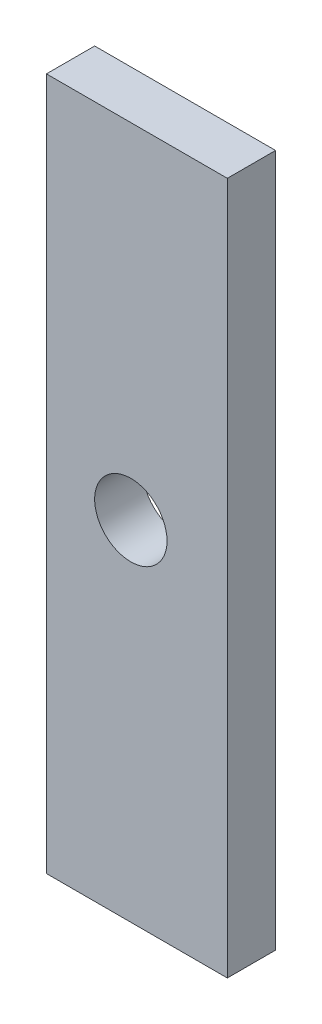
ISO-10303-21;
HEADER;
FILE_DESCRIPTION(('STEP AP214'),'2;1');
FILE_NAME('part.step','',(''),(''),'','','');
FILE_SCHEMA(('AUTOMOTIVE_DESIGN { 1 0 10303 214 1 1 1 1 }'));
ENDSEC;
DATA;
#1=APPLICATION_CONTEXT('core data for automotive mechanical design processes');
#2=APPLICATION_PROTOCOL_DEFINITION('international standard','automotive_design',2000,#1);
#3=PRODUCT_CONTEXT('',#1,'mechanical');
#4=PRODUCT('Part','Part','',(#3));
#5=PRODUCT_RELATED_PRODUCT_CATEGORY('part','',(#4));
#6=PRODUCT_DEFINITION_FORMATION('','',#4);
#7=PRODUCT_DEFINITION_CONTEXT('part definition',#1,'design');
#8=PRODUCT_DEFINITION('design','',#6,#7);
#9=PRODUCT_DEFINITION_SHAPE('','',#8);
#10=(LENGTH_UNIT() NAMED_UNIT(*) SI_UNIT(.MILLI.,.METRE.));
#11=(NAMED_UNIT(*) PLANE_ANGLE_UNIT() SI_UNIT($,.RADIAN.));
#12=(NAMED_UNIT(*) SI_UNIT($,.STERADIAN.) SOLID_ANGLE_UNIT());
#13=UNCERTAINTY_MEASURE_WITH_UNIT(LENGTH_MEASURE(1.E-05),#10,'distance_accuracy_value','');
#14=(GEOMETRIC_REPRESENTATION_CONTEXT(3) GLOBAL_UNCERTAINTY_ASSIGNED_CONTEXT((#13)) GLOBAL_UNIT_ASSIGNED_CONTEXT((#10,
#11,#12)) REPRESENTATION_CONTEXT('',''));
#15=CARTESIAN_POINT('',(0.,0.,0.));
#16=DIRECTION('',(0.,0.,1.));
#17=DIRECTION('',(1.,0.,0.));
#18=AXIS2_PLACEMENT_3D('',#15,#16,#17);
#19=CARTESIAN_POINT('',(0.,0.,2.));
#20=DIRECTION('',(0.,0.,-1.));
#21=DIRECTION('',(-1.,0.,0.));
#22=AXIS2_PLACEMENT_3D('',#19,#20,#21);
#23=PLANE('',#22);
#24=DIRECTION('',(0.,1.,0.));
#25=VECTOR('',#24,1.);
#26=CARTESIAN_POINT('',(4.,-14.441,2.));
#27=LINE('',#26,#25);
#28=CARTESIAN_POINT('',(4.,-14.441,2.));
#29=VERTEX_POINT('',#28);
#30=CARTESIAN_POINT('',(4.,14.2719690936802,2.));
#31=VERTEX_POINT('',#30);
#32=EDGE_CURVE('E84',#29,#31,#27,.T.);
#33=ORIENTED_EDGE('',*,*,#32,.T.);
#34=DIRECTION('',(-1.,0.,0.));
#35=VECTOR('',#34,1.);
#36=CARTESIAN_POINT('',(-3.5,14.2719690936802,2.));
#37=LINE('',#36,#35);
#38=CARTESIAN_POINT('',(-3.5,14.2719690936802,2.));
#39=VERTEX_POINT('',#38);
#40=EDGE_CURVE('E79',#31,#39,#37,.T.);
#41=ORIENTED_EDGE('',*,*,#40,.T.);
#42=DIRECTION('',(0.,-1.,0.));
#43=VECTOR('',#42,1.);
#44=CARTESIAN_POINT('',(-3.5,14.2719690936802,2.));
#45=LINE('',#44,#43);
#46=CARTESIAN_POINT('',(-3.5,-14.441,2.));
#47=VERTEX_POINT('',#46);
#48=EDGE_CURVE('E82',#39,#47,#45,.T.);
#49=ORIENTED_EDGE('',*,*,#48,.T.);
#50=DIRECTION('',(1.,0.,0.));
#51=VECTOR('',#50,1.);
#52=CARTESIAN_POINT('',(-3.5,-14.441,2.));
#53=LINE('',#52,#51);
#54=EDGE_CURVE('E49',#47,#29,#53,.T.);
#55=ORIENTED_EDGE('',*,*,#54,.T.);
#56=EDGE_LOOP('',(#33,#41,#49,#55));
#57=FACE_BOUND('',#56,.T.);
#58=CARTESIAN_POINT('',(0.,0.,2.));
#59=DIRECTION('',(0.,0.,1.));
#60=DIRECTION('',(1.,0.,0.));
#61=AXIS2_PLACEMENT_3D('',#58,#59,#60);
#62=CIRCLE('',#61,1.5);
#63=CARTESIAN_POINT('',(1.5,0.,2.));
#64=VERTEX_POINT('',#63);
#65=EDGE_CURVE('E99',#64,#64,#62,.T.);
#66=ORIENTED_EDGE('',*,*,#65,.F.);
#67=EDGE_LOOP('',(#66));
#68=FACE_BOUND('',#67,.T.);
#69=ADVANCED_FACE('F32',(#57,#68),#23,.F.);
#70=CARTESIAN_POINT('',(0.,0.,0.));
#71=DIRECTION('',(0.,0.,-1.));
#72=DIRECTION('',(-1.,0.,0.));
#73=AXIS2_PLACEMENT_3D('',#70,#71,#72);
#74=PLANE('',#73);
#75=DIRECTION('',(0.,1.,0.));
#76=VECTOR('',#75,1.);
#77=CARTESIAN_POINT('',(4.,-14.441,0.));
#78=LINE('',#77,#76);
#79=CARTESIAN_POINT('',(4.,-14.441,0.));
#80=VERTEX_POINT('',#79);
#81=CARTESIAN_POINT('',(4.,14.2719690936802,0.));
#82=VERTEX_POINT('',#81);
#83=EDGE_CURVE('E96',#80,#82,#78,.T.);
#84=ORIENTED_EDGE('',*,*,#83,.F.);
#85=DIRECTION('',(1.,0.,0.));
#86=VECTOR('',#85,1.);
#87=CARTESIAN_POINT('',(-3.5,-14.441,0.));
#88=LINE('',#87,#86);
#89=CARTESIAN_POINT('',(-3.5,-14.441,0.));
#90=VERTEX_POINT('',#89);
#91=EDGE_CURVE('E72',#90,#80,#88,.T.);
#92=ORIENTED_EDGE('',*,*,#91,.F.);
#93=DIRECTION('',(0.,-1.,0.));
#94=VECTOR('',#93,1.);
#95=CARTESIAN_POINT('',(-3.5,14.2719690936802,0.));
#96=LINE('',#95,#94);
#97=CARTESIAN_POINT('',(-3.5,14.2719690936802,0.));
#98=VERTEX_POINT('',#97);
#99=EDGE_CURVE('E66',#98,#90,#96,.T.);
#100=ORIENTED_EDGE('',*,*,#99,.F.);
#101=DIRECTION('',(-1.,0.,0.));
#102=VECTOR('',#101,1.);
#103=CARTESIAN_POINT('',(-3.5,14.2719690936802,0.));
#104=LINE('',#103,#102);
#105=EDGE_CURVE('E88',#82,#98,#104,.T.);
#106=ORIENTED_EDGE('',*,*,#105,.F.);
#107=EDGE_LOOP('',(#84,#92,#100,#106));
#108=FACE_BOUND('',#107,.T.);
#109=CARTESIAN_POINT('',(0.,0.,0.));
#110=DIRECTION('',(0.,0.,1.));
#111=DIRECTION('',(1.,0.,0.));
#112=AXIS2_PLACEMENT_3D('',#109,#110,#111);
#113=CIRCLE('',#112,1.5);
#114=CARTESIAN_POINT('',(1.5,0.,0.));
#115=VERTEX_POINT('',#114);
#116=EDGE_CURVE('E111',#115,#115,#113,.T.);
#117=ORIENTED_EDGE('',*,*,#116,.T.);
#118=EDGE_LOOP('',(#117));
#119=FACE_BOUND('',#118,.T.);
#120=ADVANCED_FACE('F107',(#108,#119),#74,.T.);
#121=CARTESIAN_POINT('',(4.,-14.441,2.));
#122=DIRECTION('',(-1.,0.,0.));
#123=DIRECTION('',(0.,-1.,0.));
#124=AXIS2_PLACEMENT_3D('',#121,#122,#123);
#125=PLANE('',#124);
#126=ORIENTED_EDGE('',*,*,#83,.T.);
#127=DIRECTION('',(0.,0.,-1.));
#128=VECTOR('',#127,1.);
#129=CARTESIAN_POINT('',(4.,14.2719690936802,2.));
#130=LINE('',#129,#128);
#131=EDGE_CURVE('E11',#31,#82,#130,.T.);
#132=ORIENTED_EDGE('',*,*,#131,.F.);
#133=ORIENTED_EDGE('',*,*,#32,.F.);
#134=DIRECTION('',(0.,0.,-1.));
#135=VECTOR('',#134,1.);
#136=CARTESIAN_POINT('',(4.,-14.441,2.));
#137=LINE('',#136,#135);
#138=EDGE_CURVE('E92',#29,#80,#137,.T.);
#139=ORIENTED_EDGE('',*,*,#138,.T.);
#140=EDGE_LOOP('',(#126,#132,#133,#139));
#141=FACE_BOUND('',#140,.T.);
#142=ADVANCED_FACE('F34',(#141),#125,.F.);
#143=CARTESIAN_POINT('',(-3.5,14.2719690936802,2.));
#144=DIRECTION('',(0.,-1.,0.));
#145=DIRECTION('',(0.,0.,-1.));
#146=AXIS2_PLACEMENT_3D('',#143,#144,#145);
#147=PLANE('',#146);
#148=ORIENTED_EDGE('',*,*,#105,.T.);
#149=DIRECTION('',(0.,0.,-1.));
#150=VECTOR('',#149,1.);
#151=CARTESIAN_POINT('',(-3.5,14.2719690936802,2.));
#152=LINE('',#151,#150);
#153=EDGE_CURVE('E41',#39,#98,#152,.T.);
#154=ORIENTED_EDGE('',*,*,#153,.F.);
#155=ORIENTED_EDGE('',*,*,#40,.F.);
#156=ORIENTED_EDGE('',*,*,#131,.T.);
#157=EDGE_LOOP('',(#148,#154,#155,#156));
#158=FACE_BOUND('',#157,.T.);
#159=ADVANCED_FACE('F87',(#158),#147,.F.);
#160=CARTESIAN_POINT('',(-3.5,14.2719690936802,2.));
#161=DIRECTION('',(1.,0.,0.));
#162=DIRECTION('',(0.,1.,0.));
#163=AXIS2_PLACEMENT_3D('',#160,#161,#162);
#164=PLANE('',#163);
#165=ORIENTED_EDGE('',*,*,#99,.T.);
#166=DIRECTION('',(0.,0.,-1.));
#167=VECTOR('',#166,1.);
#168=CARTESIAN_POINT('',(-3.5,-14.441,2.));
#169=LINE('',#168,#167);
#170=EDGE_CURVE('E89',#47,#90,#169,.T.);
#171=ORIENTED_EDGE('',*,*,#170,.F.);
#172=ORIENTED_EDGE('',*,*,#48,.F.);
#173=ORIENTED_EDGE('',*,*,#153,.T.);
#174=EDGE_LOOP('',(#165,#171,#172,#173));
#175=FACE_BOUND('',#174,.T.);
#176=ADVANCED_FACE('F90',(#175),#164,.F.);
#177=CARTESIAN_POINT('',(-3.5,-14.441,2.));
#178=DIRECTION('',(0.,1.,0.));
#179=DIRECTION('',(0.,0.,1.));
#180=AXIS2_PLACEMENT_3D('',#177,#178,#179);
#181=PLANE('',#180);
#182=ORIENTED_EDGE('',*,*,#91,.T.);
#183=ORIENTED_EDGE('',*,*,#138,.F.);
#184=ORIENTED_EDGE('',*,*,#54,.F.);
#185=ORIENTED_EDGE('',*,*,#170,.T.);
#186=EDGE_LOOP('',(#182,#183,#184,#185));
#187=FACE_BOUND('',#186,.T.);
#188=ADVANCED_FACE('F104',(#187),#181,.F.);
#189=CARTESIAN_POINT('',(0.,0.,2.));
#190=DIRECTION('',(0.,0.,-1.));
#191=DIRECTION('',(-1.,0.,0.));
#192=AXIS2_PLACEMENT_3D('',#189,#190,#191);
#193=CYLINDRICAL_SURFACE('',#192,1.5);
#194=ORIENTED_EDGE('',*,*,#65,.T.);
#195=EDGE_LOOP('',(#194));
#196=FACE_BOUND('',#195,.T.);
#197=ORIENTED_EDGE('',*,*,#116,.F.);
#198=EDGE_LOOP('',(#197));
#199=FACE_BOUND('',#198,.T.);
#200=ADVANCED_FACE('F117',(#196,#199),#193,.F.);
#201=CLOSED_SHELL('',(#69,#120,#142,#159,#176,#188,#200));
#202=MANIFOLD_SOLID_BREP('B2',#201);
#203=ADVANCED_BREP_SHAPE_REPRESENTATION('',(#18,#202),#14);
#204=SHAPE_DEFINITION_REPRESENTATION(#9,#203);
ENDSEC;
END-ISO-10303-21;
